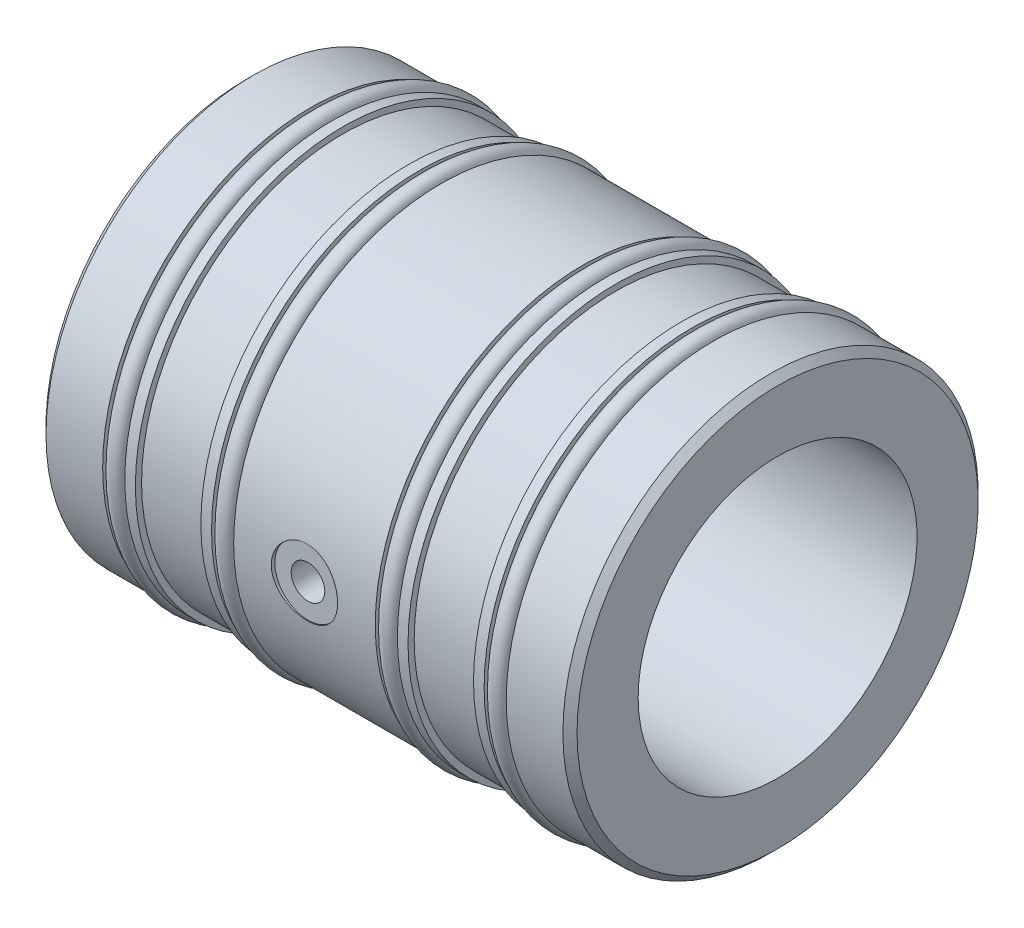
ISO-10303-21;
HEADER;
FILE_DESCRIPTION(('STEP AP214'),'2;1');
FILE_NAME('part.step','',(''),(''),'','','');
FILE_SCHEMA(('AUTOMOTIVE_DESIGN { 1 0 10303 214 1 1 1 1 }'));
ENDSEC;
DATA;
#1=APPLICATION_CONTEXT('core data for automotive mechanical design processes');
#2=APPLICATION_PROTOCOL_DEFINITION('international standard','automotive_design',2000,#1);
#3=PRODUCT_CONTEXT('',#1,'mechanical');
#4=PRODUCT('Part','Part','',(#3));
#5=PRODUCT_RELATED_PRODUCT_CATEGORY('part','',(#4));
#6=PRODUCT_DEFINITION_FORMATION('','',#4);
#7=PRODUCT_DEFINITION_CONTEXT('part definition',#1,'design');
#8=PRODUCT_DEFINITION('design','',#6,#7);
#9=PRODUCT_DEFINITION_SHAPE('','',#8);
#10=(LENGTH_UNIT() NAMED_UNIT(*) SI_UNIT(.MILLI.,.METRE.));
#11=(NAMED_UNIT(*) PLANE_ANGLE_UNIT() SI_UNIT($,.RADIAN.));
#12=(NAMED_UNIT(*) SI_UNIT($,.STERADIAN.) SOLID_ANGLE_UNIT());
#13=UNCERTAINTY_MEASURE_WITH_UNIT(LENGTH_MEASURE(1.E-05),#10,'distance_accuracy_value','');
#14=(GEOMETRIC_REPRESENTATION_CONTEXT(3) GLOBAL_UNCERTAINTY_ASSIGNED_CONTEXT((#13)) GLOBAL_UNIT_ASSIGNED_CONTEXT((#10,
#11,#12)) REPRESENTATION_CONTEXT('',''));
#15=CARTESIAN_POINT('',(0.,0.,0.));
#16=DIRECTION('',(0.,0.,1.));
#17=DIRECTION('',(1.,0.,0.));
#18=AXIS2_PLACEMENT_3D('',#15,#16,#17);
#19=CARTESIAN_POINT('',(10.7315,0.,0.));
#20=DIRECTION('',(-1.,0.,0.));
#21=DIRECTION('',(0.,0.,1.));
#22=AXIS2_PLACEMENT_3D('',#19,#20,#21);
#23=TOROIDAL_SURFACE('',#22,29.0957,1.2827);
#24=CARTESIAN_POINT('',(10.7315,0.,30.3784));
#25=VERTEX_POINT('',#24);
#26=VERTEX_LOOP('',#25);
#27=FACE_BOUND('',#26,.T.);
#28=ADVANCED_FACE('F47',(#27),#23,.T.);
#29=CLOSED_SHELL('',(#28));
#30=MANIFOLD_SOLID_BREP('B2',#29);
#31=CARTESIAN_POINT('',(26.3575,0.,0.));
#32=DIRECTION('',(-1.,0.,0.));
#33=DIRECTION('',(0.,0.,1.));
#34=AXIS2_PLACEMENT_3D('',#31,#32,#33);
#35=TOROIDAL_SURFACE('',#34,29.0957,1.2827);
#36=CARTESIAN_POINT('',(26.3575,0.,30.3784));
#37=VERTEX_POINT('',#36);
#38=VERTEX_LOOP('',#37);
#39=FACE_BOUND('',#38,.T.);
#40=ADVANCED_FACE('F65',(#39),#35,.T.);
#41=CLOSED_SHELL('',(#40));
#42=MANIFOLD_SOLID_BREP('B8',#41);
#43=CARTESIAN_POINT('',(49.8475,0.,0.));
#44=DIRECTION('',(-1.,0.,0.));
#45=DIRECTION('',(0.,0.,1.));
#46=AXIS2_PLACEMENT_3D('',#43,#44,#45);
#47=TOROIDAL_SURFACE('',#46,29.0957,1.2827);
#48=CARTESIAN_POINT('',(49.8475,0.,30.3784));
#49=VERTEX_POINT('',#48);
#50=VERTEX_LOOP('',#49);
#51=FACE_BOUND('',#50,.T.);
#52=ADVANCED_FACE('F85',(#51),#47,.T.);
#53=CLOSED_SHELL('',(#52));
#54=MANIFOLD_SOLID_BREP('B43',#53);
#55=CARTESIAN_POINT('',(65.4675,0.,0.));
#56=DIRECTION('',(-1.,0.,0.));
#57=DIRECTION('',(0.,0.,1.));
#58=AXIS2_PLACEMENT_3D('',#55,#56,#57);
#59=TOROIDAL_SURFACE('',#58,29.0957,1.28269999999999);
#60=CARTESIAN_POINT('',(65.4675,0.,30.3784));
#61=VERTEX_POINT('',#60);
#62=VERTEX_LOOP('',#61);
#63=FACE_BOUND('',#62,.T.);
#64=ADVANCED_FACE('F114',(#63),#59,.T.);
#65=CLOSED_SHELL('',(#64));
#66=MANIFOLD_SOLID_BREP('B61',#65);
#67=CARTESIAN_POINT('',(0.,20.01,0.));
#68=DIRECTION('',(1.,0.,0.));
#69=DIRECTION('',(0.,0.,-1.));
#70=AXIS2_PLACEMENT_3D('',#67,#68,#69);
#71=PLANE('',#70);
#72=CARTESIAN_POINT('',(0.,0.,0.));
#73=DIRECTION('',(1.,0.,0.));
#74=DIRECTION('',(0.,0.,-1.));
#75=AXIS2_PLACEMENT_3D('',#72,#73,#74);
#76=CIRCLE('',#75,28.7782);
#77=CARTESIAN_POINT('',(0.,0.,-28.7782));
#78=VERTEX_POINT('',#77);
#79=EDGE_CURVE('E255',#78,#78,#76,.F.);
#80=ORIENTED_EDGE('',*,*,#79,.T.);
#81=EDGE_LOOP('',(#80));
#82=FACE_BOUND('',#81,.T.);
#83=CARTESIAN_POINT('',(0.,0.,0.));
#84=DIRECTION('',(-1.,0.,0.));
#85=DIRECTION('',(0.,0.,1.));
#86=AXIS2_PLACEMENT_3D('',#83,#84,#85);
#87=CIRCLE('',#86,20.01);
#88=CARTESIAN_POINT('',(0.,0.,20.01));
#89=VERTEX_POINT('',#88);
#90=EDGE_CURVE('E177',#89,#89,#87,.T.);
#91=ORIENTED_EDGE('',*,*,#90,.F.);
#92=EDGE_LOOP('',(#91));
#93=FACE_BOUND('',#92,.T.);
#94=ADVANCED_FACE('F132',(#82,#93),#71,.F.);
#95=CARTESIAN_POINT('',(0.,0.,0.));
#96=DIRECTION('',(-1.,0.,0.));
#97=DIRECTION('',(0.,0.,1.));
#98=AXIS2_PLACEMENT_3D('',#95,#96,#97);
#99=CYLINDRICAL_SURFACE('',#98,29.7942);
#100=CARTESIAN_POINT('',(1.016,0.,0.));
#101=DIRECTION('',(1.,0.,0.));
#102=DIRECTION('',(0.,0.,-1.));
#103=AXIS2_PLACEMENT_3D('',#100,#101,#102);
#104=CIRCLE('',#103,29.7942);
#105=CARTESIAN_POINT('',(1.016,0.,-29.7942));
#106=VERTEX_POINT('',#105);
#107=EDGE_CURVE('E258',#106,#106,#104,.T.);
#108=ORIENTED_EDGE('',*,*,#107,.T.);
#109=EDGE_LOOP('',(#108));
#110=FACE_BOUND('',#109,.T.);
#111=CARTESIAN_POINT('',(9.144,0.,0.));
#112=DIRECTION('',(-1.,0.,0.));
#113=DIRECTION('',(0.,0.,1.));
#114=AXIS2_PLACEMENT_3D('',#111,#112,#113);
#115=CIRCLE('',#114,29.7942);
#116=CARTESIAN_POINT('',(9.144,0.,29.7942));
#117=VERTEX_POINT('',#116);
#118=EDGE_CURVE('E252',#117,#117,#115,.T.);
#119=ORIENTED_EDGE('',*,*,#118,.T.);
#120=EDGE_LOOP('',(#119));
#121=FACE_BOUND('',#120,.T.);
#122=ADVANCED_FACE('F353',(#110,#121),#99,.T.);
#123=CARTESIAN_POINT('',(9.144,29.7942,0.));
#124=DIRECTION('',(-1.,0.,0.));
#125=DIRECTION('',(0.,0.,1.));
#126=AXIS2_PLACEMENT_3D('',#123,#124,#125);
#127=PLANE('',#126);
#128=ORIENTED_EDGE('',*,*,#118,.F.);
#129=EDGE_LOOP('',(#128));
#130=FACE_BOUND('',#129,.T.);
#131=CARTESIAN_POINT('',(9.144,0.,0.));
#132=DIRECTION('',(-1.,0.,0.));
#133=DIRECTION('',(0.,0.,1.));
#134=AXIS2_PLACEMENT_3D('',#131,#132,#133);
#135=CIRCLE('',#134,27.813);
#136=CARTESIAN_POINT('',(9.144,0.,27.813));
#137=VERTEX_POINT('',#136);
#138=EDGE_CURVE('E249',#137,#137,#135,.T.);
#139=ORIENTED_EDGE('',*,*,#138,.T.);
#140=EDGE_LOOP('',(#139));
#141=FACE_BOUND('',#140,.T.);
#142=ADVANCED_FACE('F359',(#130,#141),#127,.F.);
#143=CARTESIAN_POINT('',(0.,0.,0.));
#144=DIRECTION('',(-1.,0.,0.));
#145=DIRECTION('',(0.,0.,1.));
#146=AXIS2_PLACEMENT_3D('',#143,#144,#145);
#147=CYLINDRICAL_SURFACE('',#146,27.813);
#148=ORIENTED_EDGE('',*,*,#138,.F.);
#149=EDGE_LOOP('',(#148));
#150=FACE_BOUND('',#149,.T.);
#151=CARTESIAN_POINT('',(12.319,0.,0.));
#152=DIRECTION('',(-1.,0.,0.));
#153=DIRECTION('',(0.,0.,1.));
#154=AXIS2_PLACEMENT_3D('',#151,#152,#153);
#155=CIRCLE('',#154,27.813);
#156=CARTESIAN_POINT('',(12.319,0.,27.813));
#157=VERTEX_POINT('',#156);
#158=EDGE_CURVE('E246',#157,#157,#155,.T.);
#159=ORIENTED_EDGE('',*,*,#158,.T.);
#160=EDGE_LOOP('',(#159));
#161=FACE_BOUND('',#160,.T.);
#162=ADVANCED_FACE('F383',(#150,#161),#147,.T.);
#163=CARTESIAN_POINT('',(12.319,27.813,0.));
#164=DIRECTION('',(1.,0.,0.));
#165=DIRECTION('',(0.,0.,-1.));
#166=AXIS2_PLACEMENT_3D('',#163,#164,#165);
#167=PLANE('',#166);
#168=ORIENTED_EDGE('',*,*,#158,.F.);
#169=EDGE_LOOP('',(#168));
#170=FACE_BOUND('',#169,.T.);
#171=CARTESIAN_POINT('',(12.319,0.,0.));
#172=DIRECTION('',(-1.,0.,0.));
#173=DIRECTION('',(0.,0.,1.));
#174=AXIS2_PLACEMENT_3D('',#171,#172,#173);
#175=CIRCLE('',#174,29.7942);
#176=CARTESIAN_POINT('',(12.319,0.,29.7942));
#177=VERTEX_POINT('',#176);
#178=EDGE_CURVE('E243',#177,#177,#175,.T.);
#179=ORIENTED_EDGE('',*,*,#178,.T.);
#180=EDGE_LOOP('',(#179));
#181=FACE_BOUND('',#180,.T.);
#182=ADVANCED_FACE('F388',(#170,#181),#167,.F.);
#183=CARTESIAN_POINT('',(0.,0.,0.));
#184=DIRECTION('',(-1.,0.,0.));
#185=DIRECTION('',(0.,0.,1.));
#186=AXIS2_PLACEMENT_3D('',#183,#184,#185);
#187=CYLINDRICAL_SURFACE('',#186,29.7942);
#188=ORIENTED_EDGE('',*,*,#178,.F.);
#189=EDGE_LOOP('',(#188));
#190=FACE_BOUND('',#189,.T.);
#191=CARTESIAN_POINT('',(13.84,0.,0.));
#192=DIRECTION('',(-1.,0.,0.));
#193=DIRECTION('',(0.,0.,1.));
#194=AXIS2_PLACEMENT_3D('',#191,#192,#193);
#195=CIRCLE('',#194,29.7942);
#196=CARTESIAN_POINT('',(13.84,0.,29.7942));
#197=VERTEX_POINT('',#196);
#198=EDGE_CURVE('E240',#197,#197,#195,.T.);
#199=ORIENTED_EDGE('',*,*,#198,.T.);
#200=EDGE_LOOP('',(#199));
#201=FACE_BOUND('',#200,.T.);
#202=ADVANCED_FACE('F394',(#190,#201),#187,.T.);
#203=CARTESIAN_POINT('',(13.84,29.7942,0.));
#204=DIRECTION('',(-1.,0.,0.));
#205=DIRECTION('',(0.,0.,1.));
#206=AXIS2_PLACEMENT_3D('',#203,#204,#205);
#207=PLANE('',#206);
#208=ORIENTED_EDGE('',*,*,#198,.F.);
#209=EDGE_LOOP('',(#208));
#210=FACE_BOUND('',#209,.T.);
#211=CARTESIAN_POINT('',(13.84,0.,0.));
#212=DIRECTION('',(-1.,0.,0.));
#213=DIRECTION('',(0.,0.,1.));
#214=AXIS2_PLACEMENT_3D('',#211,#212,#213);
#215=CIRCLE('',#214,28.905);
#216=CARTESIAN_POINT('',(13.84,0.,28.905));
#217=VERTEX_POINT('',#216);
#218=EDGE_CURVE('E237',#217,#217,#215,.T.);
#219=ORIENTED_EDGE('',*,*,#218,.T.);
#220=EDGE_LOOP('',(#219));
#221=FACE_BOUND('',#220,.T.);
#222=ADVANCED_FACE('F400',(#210,#221),#207,.F.);
#223=CARTESIAN_POINT('',(0.,0.,0.));
#224=DIRECTION('',(-1.,0.,0.));
#225=DIRECTION('',(0.,0.,1.));
#226=AXIS2_PLACEMENT_3D('',#223,#224,#225);
#227=CYLINDRICAL_SURFACE('',#226,28.905);
#228=ORIENTED_EDGE('',*,*,#218,.F.);
#229=EDGE_LOOP('',(#228));
#230=FACE_BOUND('',#229,.T.);
#231=CARTESIAN_POINT('',(23.238,0.,0.));
#232=DIRECTION('',(-1.,0.,0.));
#233=DIRECTION('',(0.,0.,1.));
#234=AXIS2_PLACEMENT_3D('',#231,#232,#233);
#235=CIRCLE('',#234,28.905);
#236=CARTESIAN_POINT('',(23.238,0.,28.905));
#237=VERTEX_POINT('',#236);
#238=EDGE_CURVE('E234',#237,#237,#235,.T.);
#239=ORIENTED_EDGE('',*,*,#238,.T.);
#240=EDGE_LOOP('',(#239));
#241=FACE_BOUND('',#240,.T.);
#242=ADVANCED_FACE('F406',(#230,#241),#227,.T.);
#243=CARTESIAN_POINT('',(23.238,28.905,0.));
#244=DIRECTION('',(1.,0.,0.));
#245=DIRECTION('',(0.,0.,-1.));
#246=AXIS2_PLACEMENT_3D('',#243,#244,#245);
#247=PLANE('',#246);
#248=ORIENTED_EDGE('',*,*,#238,.F.);
#249=EDGE_LOOP('',(#248));
#250=FACE_BOUND('',#249,.T.);
#251=CARTESIAN_POINT('',(23.238,0.,0.));
#252=DIRECTION('',(-1.,0.,0.));
#253=DIRECTION('',(0.,0.,1.));
#254=AXIS2_PLACEMENT_3D('',#251,#252,#253);
#255=CIRCLE('',#254,29.7942);
#256=CARTESIAN_POINT('',(23.238,0.,29.7942));
#257=VERTEX_POINT('',#256);
#258=EDGE_CURVE('E231',#257,#257,#255,.T.);
#259=ORIENTED_EDGE('',*,*,#258,.T.);
#260=EDGE_LOOP('',(#259));
#261=FACE_BOUND('',#260,.T.);
#262=ADVANCED_FACE('F412',(#250,#261),#247,.F.);
#263=CARTESIAN_POINT('',(0.,0.,0.));
#264=DIRECTION('',(-1.,0.,0.));
#265=DIRECTION('',(0.,0.,1.));
#266=AXIS2_PLACEMENT_3D('',#263,#264,#265);
#267=CYLINDRICAL_SURFACE('',#266,29.7942);
#268=ORIENTED_EDGE('',*,*,#258,.F.);
#269=EDGE_LOOP('',(#268));
#270=FACE_BOUND('',#269,.T.);
#271=CARTESIAN_POINT('',(24.77,0.,0.));
#272=DIRECTION('',(-1.,0.,0.));
#273=DIRECTION('',(0.,0.,1.));
#274=AXIS2_PLACEMENT_3D('',#271,#272,#273);
#275=CIRCLE('',#274,29.7942);
#276=CARTESIAN_POINT('',(24.77,0.,29.7942));
#277=VERTEX_POINT('',#276);
#278=EDGE_CURVE('E228',#277,#277,#275,.T.);
#279=ORIENTED_EDGE('',*,*,#278,.T.);
#280=EDGE_LOOP('',(#279));
#281=FACE_BOUND('',#280,.T.);
#282=ADVANCED_FACE('F418',(#270,#281),#267,.T.);
#283=CARTESIAN_POINT('',(24.77,29.7942,0.));
#284=DIRECTION('',(-1.,0.,0.));
#285=DIRECTION('',(0.,0.,1.));
#286=AXIS2_PLACEMENT_3D('',#283,#284,#285);
#287=PLANE('',#286);
#288=ORIENTED_EDGE('',*,*,#278,.F.);
#289=EDGE_LOOP('',(#288));
#290=FACE_BOUND('',#289,.T.);
#291=CARTESIAN_POINT('',(24.77,0.,0.));
#292=DIRECTION('',(-1.,0.,0.));
#293=DIRECTION('',(0.,0.,1.));
#294=AXIS2_PLACEMENT_3D('',#291,#292,#293);
#295=CIRCLE('',#294,27.813);
#296=CARTESIAN_POINT('',(24.77,0.,27.813));
#297=VERTEX_POINT('',#296);
#298=EDGE_CURVE('E225',#297,#297,#295,.T.);
#299=ORIENTED_EDGE('',*,*,#298,.T.);
#300=EDGE_LOOP('',(#299));
#301=FACE_BOUND('',#300,.T.);
#302=ADVANCED_FACE('F424',(#290,#301),#287,.F.);
#303=CARTESIAN_POINT('',(0.,0.,0.));
#304=DIRECTION('',(-1.,0.,0.));
#305=DIRECTION('',(0.,0.,1.));
#306=AXIS2_PLACEMENT_3D('',#303,#304,#305);
#307=CYLINDRICAL_SURFACE('',#306,27.813);
#308=ORIENTED_EDGE('',*,*,#298,.F.);
#309=EDGE_LOOP('',(#308));
#310=FACE_BOUND('',#309,.T.);
#311=CARTESIAN_POINT('',(27.945,0.,0.));
#312=DIRECTION('',(-1.,0.,0.));
#313=DIRECTION('',(0.,0.,1.));
#314=AXIS2_PLACEMENT_3D('',#311,#312,#313);
#315=CIRCLE('',#314,27.813);
#316=CARTESIAN_POINT('',(27.945,0.,27.813));
#317=VERTEX_POINT('',#316);
#318=EDGE_CURVE('E222',#317,#317,#315,.T.);
#319=ORIENTED_EDGE('',*,*,#318,.T.);
#320=EDGE_LOOP('',(#319));
#321=FACE_BOUND('',#320,.T.);
#322=ADVANCED_FACE('F430',(#310,#321),#307,.T.);
#323=CARTESIAN_POINT('',(27.945,27.813,0.));
#324=DIRECTION('',(1.,0.,0.));
#325=DIRECTION('',(0.,0.,-1.));
#326=AXIS2_PLACEMENT_3D('',#323,#324,#325);
#327=PLANE('',#326);
#328=ORIENTED_EDGE('',*,*,#318,.F.);
#329=EDGE_LOOP('',(#328));
#330=FACE_BOUND('',#329,.T.);
#331=CARTESIAN_POINT('',(27.945,0.,0.));
#332=DIRECTION('',(-1.,0.,0.));
#333=DIRECTION('',(0.,0.,1.));
#334=AXIS2_PLACEMENT_3D('',#331,#332,#333);
#335=CIRCLE('',#334,29.7942);
#336=CARTESIAN_POINT('',(27.945,0.,29.7942));
#337=VERTEX_POINT('',#336);
#338=EDGE_CURVE('E219',#337,#337,#335,.T.);
#339=ORIENTED_EDGE('',*,*,#338,.T.);
#340=EDGE_LOOP('',(#339));
#341=FACE_BOUND('',#340,.T.);
#342=ADVANCED_FACE('F272',(#330,#341),#327,.F.);
#343=CARTESIAN_POINT('',(0.,0.,0.));
#344=DIRECTION('',(-1.,0.,0.));
#345=DIRECTION('',(0.,0.,1.));
#346=AXIS2_PLACEMENT_3D('',#343,#344,#345);
#347=CYLINDRICAL_SURFACE('',#346,29.7942);
#348=CARTESIAN_POINT('',(42.8625,0.,29.7942));
#349=CARTESIAN_POINT('',(42.8624892132007,-0.265696232656299,29.794195559683));
#350=CARTESIAN_POINT('',(42.8401904243504,-0.531541341606855,29.7906087780758));
#351=CARTESIAN_POINT('',(42.7516154043679,-1.05578611869581,29.7766457031698));
#352=CARTESIAN_POINT('',(42.6852977293445,-1.31417853064853,29.7662630116329));
#353=CARTESIAN_POINT('',(42.5107295237931,-1.81585641103358,29.7398736116883));
#354=CARTESIAN_POINT('',(42.4025121998012,-2.05915366604217,29.7238713578581));
#355=CARTESIAN_POINT('',(42.1473011401955,-2.52410305641405,29.6880060098751));
#356=CARTESIAN_POINT('',(42.0003122382858,-2.74575788525074,29.6681433970794));
#357=CARTESIAN_POINT('',(41.6703497389242,-3.16312009014098,29.6265661430495));
#358=CARTESIAN_POINT('',(41.4871011840987,-3.3586087774373,29.604838117186));
#359=CARTESIAN_POINT('',(41.0904129328182,-3.71620137472666,29.5620823361833));
#360=CARTESIAN_POINT('',(40.8769714049956,-3.87830325816326,29.5410546236177));
#361=CARTESIAN_POINT('',(40.424467464009,-4.16538673051056,29.5019506138127));
#362=CARTESIAN_POINT('',(40.1852674622557,-4.2901540121259,29.4838916144468));
#363=CARTESIAN_POINT('',(39.6889686423679,-4.49765652571107,29.4529542513037));
#364=CARTESIAN_POINT('',(39.4318709352742,-4.58039436411361,29.4400755662825));
#365=CARTESIAN_POINT('',(38.9093854870388,-4.70080443550343,29.4210895854793));
#366=CARTESIAN_POINT('',(38.6440865488815,-4.73885292859874,29.4149257864008));
#367=CARTESIAN_POINT('',(38.1108036737489,-4.76997043930542,29.4098962949859));
#368=CARTESIAN_POINT('',(37.8428199127547,-4.76304238597054,29.4110301273984));
#369=CARTESIAN_POINT('',(37.3144485642113,-4.70471036587982,29.4204161667424));
#370=CARTESIAN_POINT('',(37.0540131114632,-4.65372754405118,29.4286009671502));
#371=CARTESIAN_POINT('',(36.545440957085,-4.50939342311139,29.4510613010367));
#372=CARTESIAN_POINT('',(36.2973046465606,-4.4160407776212,29.4653370280648));
#373=CARTESIAN_POINT('',(35.8191050133464,-4.18918532900835,29.4984442098889));
#374=CARTESIAN_POINT('',(35.5891267898023,-4.05550617044315,29.5172956026997));
#375=CARTESIAN_POINT('',(35.154706324263,-3.75191772700624,29.5574159639437));
#376=CARTESIAN_POINT('',(34.9502659831676,-3.58200574770758,29.5786851121165));
#377=CARTESIAN_POINT('',(34.5702855259249,-3.20847301330683,29.6215413689111));
#378=CARTESIAN_POINT('',(34.3951008315647,-3.00449060216417,29.6431293411708));
#379=CARTESIAN_POINT('',(34.0813944382334,-2.5698344406157,29.6839666176117));
#380=CARTESIAN_POINT('',(33.9428729417096,-2.33916054283461,29.7032159088789));
#381=CARTESIAN_POINT('',(33.7063986670976,-1.85734621964429,29.7372311409213));
#382=CARTESIAN_POINT('',(33.6084756100169,-1.60619096078455,29.751993795049));
#383=CARTESIAN_POINT('',(33.4562989241362,-1.09071109344829,29.7753455868714));
#384=CARTESIAN_POINT('',(33.4020419383335,-0.826387498999312,29.7839351991376));
#385=CARTESIAN_POINT('',(33.3392154875883,-0.295139277827396,29.7939096827259));
#386=CARTESIAN_POINT('',(33.3301578038739,-0.0282737826080876,29.7953715402873));
#387=CARTESIAN_POINT('',(33.356687875127,0.503163101458383,29.7911361161876));
#388=CARTESIAN_POINT('',(33.3922740543942,0.767734570941078,29.7854390871986));
#389=CARTESIAN_POINT('',(33.5066756444049,1.28557747481115,29.7675736470928));
#390=CARTESIAN_POINT('',(33.5852509685452,1.53890329617438,29.755441188056));
#391=CARTESIAN_POINT('',(33.7831456063307,2.02878586382143,29.7260602105885));
#392=CARTESIAN_POINT('',(33.9024670532978,2.26534173130696,29.7088114242915));
#393=CARTESIAN_POINT('',(34.1795964674922,2.71710114333156,29.6709214992288));
#394=CARTESIAN_POINT('',(34.3377113988256,2.93211410866257,29.6502537542425));
#395=CARTESIAN_POINT('',(34.6875150748913,3.33272825549375,29.6079031927198));
#396=CARTESIAN_POINT('',(34.8792060514233,3.51832748029971,29.5862203087774));
#397=CARTESIAN_POINT('',(35.2929033549082,3.85664141510984,29.5440363491409));
#398=CARTESIAN_POINT('',(35.5151801110021,4.00902733574642,29.5235484415801));
#399=CARTESIAN_POINT('',(35.9824632900143,4.2742973238587,29.4863146934338));
#400=CARTESIAN_POINT('',(36.2274690353386,4.38718256844568,29.4695687413442));
#401=CARTESIAN_POINT('',(36.7323103456274,4.56974751333859,29.4418123130385));
#402=CARTESIAN_POINT('',(36.9920840268163,4.63959480943337,29.4307796157571));
#403=CARTESIAN_POINT('',(37.5198662282977,4.73463118852356,29.4156416999991));
#404=CARTESIAN_POINT('',(37.7878740935969,4.75982381429366,29.4115359319607));
#405=CARTESIAN_POINT('',(38.3212363613274,4.76474301876427,29.4107391124701));
#406=CARTESIAN_POINT('',(38.5865860100168,4.74498687303457,29.4139637020701));
#407=CARTESIAN_POINT('',(39.1101354014613,4.66168363339068,29.4272800363468));
#408=CARTESIAN_POINT('',(39.3683351622087,4.5981366496841,29.437371763741));
#409=CARTESIAN_POINT('',(39.8700792261828,4.42924741527534,29.463254307839));
#410=CARTESIAN_POINT('',(40.1136376433404,4.3239461836548,29.4790395299219));
#411=CARTESIAN_POINT('',(40.5797147890151,4.07458993399587,29.5145364400838));
#412=CARTESIAN_POINT('',(40.8022326117128,3.93053324852083,29.5342482970951));
#413=CARTESIAN_POINT('',(41.2225318392057,3.60589511059689,29.5756465063843));
#414=CARTESIAN_POINT('',(41.4200165887492,3.42493198692763,29.5973520695366));
#415=CARTESIAN_POINT('',(41.7819959614207,3.03242391529968,29.6401358015303));
#416=CARTESIAN_POINT('',(41.9464829404955,2.82087190079933,29.6612138240389));
#417=CARTESIAN_POINT('',(42.2387370524599,2.37161206434717,29.7005207048717));
#418=CARTESIAN_POINT('',(42.3662661536999,2.13374775550444,29.718730763375));
#419=CARTESIAN_POINT('',(42.5793652180296,1.63978601745139,29.7500665840168));
#420=CARTESIAN_POINT('',(42.6649776761307,1.38370735690902,29.7631974925394));
#421=CARTESIAN_POINT('',(42.7728753814766,0.938806062923658,29.7799742211443));
#422=CARTESIAN_POINT('',(42.8064318342777,0.752698806503795,29.7852808474148));
#423=CARTESIAN_POINT('',(42.8512478100722,0.377752760301309,29.7923952890062));
#424=CARTESIAN_POINT('',(42.8625076695763,0.188914011786973,29.7942031571321));
#425=CARTESIAN_POINT('',(42.8625,0.,29.7942));
#426=B_SPLINE_CURVE_WITH_KNOTS('',3,(#348,#349,#350,#351,#352,#353,#354,#355,#356,#357,#358,
#359,#360,#361,#362,#363,#364,#365,#366,#367,#368,#369,#370,#371,#372,#373,#374,#375,#376,#377,
#378,#379,#380,#381,#382,#383,#384,#385,#386,#387,#388,#389,#390,#391,#392,#393,#394,#395,#396,
#397,#398,#399,#400,#401,#402,#403,#404,#405,#406,#407,#408,#409,#410,#411,#412,#413,#414,#415,
#416,#417,#418,#419,#420,#421,#422,#423,#424,#425),.UNSPECIFIED.,.T.,.F.,(4,2,2,2,2,2,2,2,2,2,2,
2,2,2,2,2,2,2,2,2,2,2,2,2,2,2,2,2,2,2,2,2,2,2,2,2,2,2,4),(0.,0.796398257730296,1.59354739199217,
2.39006605422568,3.18648546031761,3.98919307483198,4.79194939880614,5.59922899038845,
6.4064585128591,7.20684174014405,8.00717284377472,8.79993671242683,9.59272577437232,
10.3890333894626,11.1854002420439,11.9908312043927,12.7962666140875,13.6022906242881,
14.4082526622677,15.2054899941328,16.0026991883847,16.7955008995793,17.5883441254124,
18.3876755964932,19.1870602193085,19.9940310074063,20.8009777459075,21.6047619263688,
22.4084823340219,23.203000283611,23.9975162336586,24.791253582914,25.5850250878388,
26.3874645539626,27.1900896939853,27.9977748509891,28.8046394740628,29.3708991423659,
29.9371502643478),.UNSPECIFIED.);
#427=CARTESIAN_POINT('',(33.3375,0.,29.7942));
#428=VERTEX_POINT('',#427);
#429=CARTESIAN_POINT('',(42.8625,0.,29.7942));
#430=VERTEX_POINT('',#429);
#431=EDGE_CURVE('E136',#428,#430,#426,.T.);
#432=ORIENTED_EDGE('',*,*,#431,.T.);
#433=EDGE_CURVE('E112',#430,#428,#426,.T.);
#434=ORIENTED_EDGE('',*,*,#433,.T.);
#435=EDGE_LOOP('',(#432,#434));
#436=FACE_BOUND('',#435,.T.);
#437=ORIENTED_EDGE('',*,*,#338,.F.);
#438=EDGE_LOOP('',(#437));
#439=FACE_BOUND('',#438,.T.);
#440=CARTESIAN_POINT('',(48.26,0.,0.));
#441=DIRECTION('',(-1.,0.,0.));
#442=DIRECTION('',(0.,0.,1.));
#443=AXIS2_PLACEMENT_3D('',#440,#441,#442);
#444=CIRCLE('',#443,29.7942);
#445=CARTESIAN_POINT('',(48.26,0.,29.7942));
#446=VERTEX_POINT('',#445);
#447=EDGE_CURVE('E216',#446,#446,#444,.T.);
#448=ORIENTED_EDGE('',*,*,#447,.T.);
#449=EDGE_LOOP('',(#448));
#450=FACE_BOUND('',#449,.T.);
#451=ADVANCED_FACE('F268',(#436,#439,#450),#347,.T.);
#452=CARTESIAN_POINT('',(48.26,29.7942,0.));
#453=DIRECTION('',(-1.,0.,0.));
#454=DIRECTION('',(0.,0.,1.));
#455=AXIS2_PLACEMENT_3D('',#452,#453,#454);
#456=PLANE('',#455);
#457=ORIENTED_EDGE('',*,*,#447,.F.);
#458=EDGE_LOOP('',(#457));
#459=FACE_BOUND('',#458,.T.);
#460=CARTESIAN_POINT('',(48.26,0.,0.));
#461=DIRECTION('',(-1.,0.,0.));
#462=DIRECTION('',(0.,0.,1.));
#463=AXIS2_PLACEMENT_3D('',#460,#461,#462);
#464=CIRCLE('',#463,27.813);
#465=CARTESIAN_POINT('',(48.26,0.,27.813));
#466=VERTEX_POINT('',#465);
#467=EDGE_CURVE('E213',#466,#466,#464,.T.);
#468=ORIENTED_EDGE('',*,*,#467,.T.);
#469=EDGE_LOOP('',(#468));
#470=FACE_BOUND('',#469,.T.);
#471=ADVANCED_FACE('F271',(#459,#470),#456,.F.);
#472=CARTESIAN_POINT('',(0.,0.,0.));
#473=DIRECTION('',(-1.,0.,0.));
#474=DIRECTION('',(0.,0.,1.));
#475=AXIS2_PLACEMENT_3D('',#472,#473,#474);
#476=CYLINDRICAL_SURFACE('',#475,27.813);
#477=ORIENTED_EDGE('',*,*,#467,.F.);
#478=EDGE_LOOP('',(#477));
#479=FACE_BOUND('',#478,.T.);
#480=CARTESIAN_POINT('',(51.435,0.,0.));
#481=DIRECTION('',(-1.,0.,0.));
#482=DIRECTION('',(0.,0.,1.));
#483=AXIS2_PLACEMENT_3D('',#480,#481,#482);
#484=CIRCLE('',#483,27.813);
#485=CARTESIAN_POINT('',(51.435,0.,27.813));
#486=VERTEX_POINT('',#485);
#487=EDGE_CURVE('E210',#486,#486,#484,.T.);
#488=ORIENTED_EDGE('',*,*,#487,.T.);
#489=EDGE_LOOP('',(#488));
#490=FACE_BOUND('',#489,.T.);
#491=ADVANCED_FACE('F279',(#479,#490),#476,.T.);
#492=CARTESIAN_POINT('',(51.435,29.7942,0.));
#493=DIRECTION('',(1.,0.,0.));
#494=DIRECTION('',(0.,0.,-1.));
#495=AXIS2_PLACEMENT_3D('',#492,#493,#494);
#496=PLANE('',#495);
#497=ORIENTED_EDGE('',*,*,#487,.F.);
#498=EDGE_LOOP('',(#497));
#499=FACE_BOUND('',#498,.T.);
#500=CARTESIAN_POINT('',(51.435,0.,0.));
#501=DIRECTION('',(-1.,0.,0.));
#502=DIRECTION('',(0.,0.,1.));
#503=AXIS2_PLACEMENT_3D('',#500,#501,#502);
#504=CIRCLE('',#503,29.7942);
#505=CARTESIAN_POINT('',(51.435,0.,29.7942));
#506=VERTEX_POINT('',#505);
#507=EDGE_CURVE('E207',#506,#506,#504,.T.);
#508=ORIENTED_EDGE('',*,*,#507,.T.);
#509=EDGE_LOOP('',(#508));
#510=FACE_BOUND('',#509,.T.);
#511=ADVANCED_FACE('F285',(#499,#510),#496,.F.);
#512=CARTESIAN_POINT('',(0.,0.,0.));
#513=DIRECTION('',(-1.,0.,0.));
#514=DIRECTION('',(0.,0.,1.));
#515=AXIS2_PLACEMENT_3D('',#512,#513,#514);
#516=CYLINDRICAL_SURFACE('',#515,29.7942);
#517=ORIENTED_EDGE('',*,*,#507,.F.);
#518=EDGE_LOOP('',(#517));
#519=FACE_BOUND('',#518,.T.);
#520=CARTESIAN_POINT('',(52.96,0.,0.));
#521=DIRECTION('',(-1.,0.,0.));
#522=DIRECTION('',(0.,0.,1.));
#523=AXIS2_PLACEMENT_3D('',#520,#521,#522);
#524=CIRCLE('',#523,29.7942);
#525=CARTESIAN_POINT('',(52.96,0.,29.7942));
#526=VERTEX_POINT('',#525);
#527=EDGE_CURVE('E204',#526,#526,#524,.T.);
#528=ORIENTED_EDGE('',*,*,#527,.T.);
#529=EDGE_LOOP('',(#528));
#530=FACE_BOUND('',#529,.T.);
#531=ADVANCED_FACE('F291',(#519,#530),#516,.T.);
#532=CARTESIAN_POINT('',(52.96,28.905,0.));
#533=DIRECTION('',(-1.,0.,0.));
#534=DIRECTION('',(0.,0.,1.));
#535=AXIS2_PLACEMENT_3D('',#532,#533,#534);
#536=PLANE('',#535);
#537=ORIENTED_EDGE('',*,*,#527,.F.);
#538=EDGE_LOOP('',(#537));
#539=FACE_BOUND('',#538,.T.);
#540=CARTESIAN_POINT('',(52.96,0.,0.));
#541=DIRECTION('',(-1.,0.,0.));
#542=DIRECTION('',(0.,0.,1.));
#543=AXIS2_PLACEMENT_3D('',#540,#541,#542);
#544=CIRCLE('',#543,28.905);
#545=CARTESIAN_POINT('',(52.96,0.,28.905));
#546=VERTEX_POINT('',#545);
#547=EDGE_CURVE('E201',#546,#546,#544,.T.);
#548=ORIENTED_EDGE('',*,*,#547,.T.);
#549=EDGE_LOOP('',(#548));
#550=FACE_BOUND('',#549,.T.);
#551=ADVANCED_FACE('F297',(#539,#550),#536,.F.);
#552=CARTESIAN_POINT('',(0.,0.,0.));
#553=DIRECTION('',(-1.,0.,0.));
#554=DIRECTION('',(0.,0.,1.));
#555=AXIS2_PLACEMENT_3D('',#552,#553,#554);
#556=CYLINDRICAL_SURFACE('',#555,28.905);
#557=ORIENTED_EDGE('',*,*,#547,.F.);
#558=EDGE_LOOP('',(#557));
#559=FACE_BOUND('',#558,.T.);
#560=CARTESIAN_POINT('',(62.358,0.,0.));
#561=DIRECTION('',(-1.,0.,0.));
#562=DIRECTION('',(0.,0.,1.));
#563=AXIS2_PLACEMENT_3D('',#560,#561,#562);
#564=CIRCLE('',#563,28.905);
#565=CARTESIAN_POINT('',(62.358,0.,28.905));
#566=VERTEX_POINT('',#565);
#567=EDGE_CURVE('E198',#566,#566,#564,.T.);
#568=ORIENTED_EDGE('',*,*,#567,.T.);
#569=EDGE_LOOP('',(#568));
#570=FACE_BOUND('',#569,.T.);
#571=ADVANCED_FACE('F303',(#559,#570),#556,.T.);
#572=CARTESIAN_POINT('',(62.358,29.7942,0.));
#573=DIRECTION('',(1.,0.,0.));
#574=DIRECTION('',(0.,0.,-1.));
#575=AXIS2_PLACEMENT_3D('',#572,#573,#574);
#576=PLANE('',#575);
#577=ORIENTED_EDGE('',*,*,#567,.F.);
#578=EDGE_LOOP('',(#577));
#579=FACE_BOUND('',#578,.T.);
#580=CARTESIAN_POINT('',(62.358,0.,0.));
#581=DIRECTION('',(-1.,0.,0.));
#582=DIRECTION('',(0.,0.,1.));
#583=AXIS2_PLACEMENT_3D('',#580,#581,#582);
#584=CIRCLE('',#583,29.7942);
#585=CARTESIAN_POINT('',(62.358,0.,29.7942));
#586=VERTEX_POINT('',#585);
#587=EDGE_CURVE('E195',#586,#586,#584,.T.);
#588=ORIENTED_EDGE('',*,*,#587,.T.);
#589=EDGE_LOOP('',(#588));
#590=FACE_BOUND('',#589,.T.);
#591=ADVANCED_FACE('F309',(#579,#590),#576,.F.);
#592=CARTESIAN_POINT('',(0.,0.,0.));
#593=DIRECTION('',(-1.,0.,0.));
#594=DIRECTION('',(0.,0.,1.));
#595=AXIS2_PLACEMENT_3D('',#592,#593,#594);
#596=CYLINDRICAL_SURFACE('',#595,29.7942);
#597=ORIENTED_EDGE('',*,*,#587,.F.);
#598=EDGE_LOOP('',(#597));
#599=FACE_BOUND('',#598,.T.);
#600=CARTESIAN_POINT('',(63.88,0.,0.));
#601=DIRECTION('',(-1.,0.,0.));
#602=DIRECTION('',(0.,0.,1.));
#603=AXIS2_PLACEMENT_3D('',#600,#601,#602);
#604=CIRCLE('',#603,29.7942);
#605=CARTESIAN_POINT('',(63.88,0.,29.7942));
#606=VERTEX_POINT('',#605);
#607=EDGE_CURVE('E192',#606,#606,#604,.T.);
#608=ORIENTED_EDGE('',*,*,#607,.T.);
#609=EDGE_LOOP('',(#608));
#610=FACE_BOUND('',#609,.T.);
#611=ADVANCED_FACE('F315',(#599,#610),#596,.T.);
#612=CARTESIAN_POINT('',(63.88,27.813,0.));
#613=DIRECTION('',(-1.,0.,0.));
#614=DIRECTION('',(0.,0.,1.));
#615=AXIS2_PLACEMENT_3D('',#612,#613,#614);
#616=PLANE('',#615);
#617=ORIENTED_EDGE('',*,*,#607,.F.);
#618=EDGE_LOOP('',(#617));
#619=FACE_BOUND('',#618,.T.);
#620=CARTESIAN_POINT('',(63.88,0.,0.));
#621=DIRECTION('',(-1.,0.,0.));
#622=DIRECTION('',(0.,0.,1.));
#623=AXIS2_PLACEMENT_3D('',#620,#621,#622);
#624=CIRCLE('',#623,27.813);
#625=CARTESIAN_POINT('',(63.88,0.,27.813));
#626=VERTEX_POINT('',#625);
#627=EDGE_CURVE('E189',#626,#626,#624,.T.);
#628=ORIENTED_EDGE('',*,*,#627,.T.);
#629=EDGE_LOOP('',(#628));
#630=FACE_BOUND('',#629,.T.);
#631=ADVANCED_FACE('F321',(#619,#630),#616,.F.);
#632=CARTESIAN_POINT('',(0.,0.,0.));
#633=DIRECTION('',(-1.,0.,0.));
#634=DIRECTION('',(0.,0.,1.));
#635=AXIS2_PLACEMENT_3D('',#632,#633,#634);
#636=CYLINDRICAL_SURFACE('',#635,27.813);
#637=ORIENTED_EDGE('',*,*,#627,.F.);
#638=EDGE_LOOP('',(#637));
#639=FACE_BOUND('',#638,.T.);
#640=CARTESIAN_POINT('',(67.055,0.,0.));
#641=DIRECTION('',(-1.,0.,0.));
#642=DIRECTION('',(0.,0.,1.));
#643=AXIS2_PLACEMENT_3D('',#640,#641,#642);
#644=CIRCLE('',#643,27.813);
#645=CARTESIAN_POINT('',(67.055,0.,27.813));
#646=VERTEX_POINT('',#645);
#647=EDGE_CURVE('E186',#646,#646,#644,.T.);
#648=ORIENTED_EDGE('',*,*,#647,.T.);
#649=EDGE_LOOP('',(#648));
#650=FACE_BOUND('',#649,.T.);
#651=ADVANCED_FACE('F327',(#639,#650),#636,.T.);
#652=CARTESIAN_POINT('',(67.055,29.7942,0.));
#653=DIRECTION('',(1.,0.,0.));
#654=DIRECTION('',(0.,0.,-1.));
#655=AXIS2_PLACEMENT_3D('',#652,#653,#654);
#656=PLANE('',#655);
#657=ORIENTED_EDGE('',*,*,#647,.F.);
#658=EDGE_LOOP('',(#657));
#659=FACE_BOUND('',#658,.T.);
#660=CARTESIAN_POINT('',(67.055,0.,0.));
#661=DIRECTION('',(-1.,0.,0.));
#662=DIRECTION('',(0.,0.,1.));
#663=AXIS2_PLACEMENT_3D('',#660,#661,#662);
#664=CIRCLE('',#663,29.7942);
#665=CARTESIAN_POINT('',(67.055,0.,29.7942));
#666=VERTEX_POINT('',#665);
#667=EDGE_CURVE('E183',#666,#666,#664,.T.);
#668=ORIENTED_EDGE('',*,*,#667,.T.);
#669=EDGE_LOOP('',(#668));
#670=FACE_BOUND('',#669,.T.);
#671=ADVANCED_FACE('F333',(#659,#670),#656,.F.);
#672=CARTESIAN_POINT('',(0.,0.,0.));
#673=DIRECTION('',(-1.,0.,0.));
#674=DIRECTION('',(0.,0.,1.));
#675=AXIS2_PLACEMENT_3D('',#672,#673,#674);
#676=CYLINDRICAL_SURFACE('',#675,29.7942);
#677=CARTESIAN_POINT('',(75.184,0.,0.));
#678=DIRECTION('',(-1.,0.,0.));
#679=DIRECTION('',(0.,0.,1.));
#680=AXIS2_PLACEMENT_3D('',#677,#678,#679);
#681=CIRCLE('',#680,29.7942);
#682=CARTESIAN_POINT('',(75.184,0.,29.7942));
#683=VERTEX_POINT('',#682);
#684=EDGE_CURVE('E261',#683,#683,#681,.T.);
#685=ORIENTED_EDGE('',*,*,#684,.T.);
#686=EDGE_LOOP('',(#685));
#687=FACE_BOUND('',#686,.T.);
#688=ORIENTED_EDGE('',*,*,#667,.F.);
#689=EDGE_LOOP('',(#688));
#690=FACE_BOUND('',#689,.T.);
#691=ADVANCED_FACE('F339',(#687,#690),#676,.T.);
#692=CARTESIAN_POINT('',(76.2,20.01,0.));
#693=DIRECTION('',(-1.,0.,0.));
#694=DIRECTION('',(0.,0.,1.));
#695=AXIS2_PLACEMENT_3D('',#692,#693,#694);
#696=PLANE('',#695);
#697=CARTESIAN_POINT('',(76.2,0.,0.));
#698=DIRECTION('',(-1.,0.,0.));
#699=DIRECTION('',(0.,0.,1.));
#700=AXIS2_PLACEMENT_3D('',#697,#698,#699);
#701=CIRCLE('',#700,28.7782);
#702=CARTESIAN_POINT('',(76.2,0.,28.7782));
#703=VERTEX_POINT('',#702);
#704=EDGE_CURVE('E263',#703,#703,#701,.F.);
#705=ORIENTED_EDGE('',*,*,#704,.T.);
#706=EDGE_LOOP('',(#705));
#707=FACE_BOUND('',#706,.T.);
#708=CARTESIAN_POINT('',(76.2,0.,0.));
#709=DIRECTION('',(-1.,0.,0.));
#710=DIRECTION('',(0.,0.,1.));
#711=AXIS2_PLACEMENT_3D('',#708,#709,#710);
#712=CIRCLE('',#711,20.01);
#713=CARTESIAN_POINT('',(76.2,0.,20.01));
#714=VERTEX_POINT('',#713);
#715=EDGE_CURVE('E180',#714,#714,#712,.T.);
#716=ORIENTED_EDGE('',*,*,#715,.T.);
#717=EDGE_LOOP('',(#716));
#718=FACE_BOUND('',#717,.T.);
#719=ADVANCED_FACE('F344',(#707,#718),#696,.F.);
#720=CARTESIAN_POINT('',(0.,0.,0.));
#721=DIRECTION('',(-1.,0.,0.));
#722=DIRECTION('',(0.,0.,1.));
#723=AXIS2_PLACEMENT_3D('',#720,#721,#722);
#724=CYLINDRICAL_SURFACE('',#723,20.01);
#725=ORIENTED_EDGE('',*,*,#715,.F.);
#726=EDGE_LOOP('',(#725));
#727=FACE_BOUND('',#726,.T.);
#728=ORIENTED_EDGE('',*,*,#90,.T.);
#729=EDGE_LOOP('',(#728));
#730=FACE_BOUND('',#729,.T.);
#731=ADVANCED_FACE('F350',(#727,#730),#724,.F.);
#732=CARTESIAN_POINT('',(0.,0.,0.));
#733=DIRECTION('',(1.,0.,0.));
#734=DIRECTION('',(0.,0.,-1.));
#735=AXIS2_PLACEMENT_3D('',#732,#733,#734);
#736=CONICAL_SURFACE('',#735,28.7782,0.785398163397442);
#737=ORIENTED_EDGE('',*,*,#107,.F.);
#738=EDGE_LOOP('',(#737));
#739=FACE_BOUND('',#738,.T.);
#740=ORIENTED_EDGE('',*,*,#79,.F.);
#741=EDGE_LOOP('',(#740));
#742=FACE_BOUND('',#741,.T.);
#743=ADVANCED_FACE('F364',(#739,#742),#736,.T.);
#744=CARTESIAN_POINT('',(75.184,0.,0.));
#745=DIRECTION('',(-1.,0.,0.));
#746=DIRECTION('',(0.,0.,1.));
#747=AXIS2_PLACEMENT_3D('',#744,#745,#746);
#748=CONICAL_SURFACE('',#747,29.7942,0.785398163397448);
#749=ORIENTED_EDGE('',*,*,#704,.F.);
#750=EDGE_LOOP('',(#749));
#751=FACE_BOUND('',#750,.T.);
#752=ORIENTED_EDGE('',*,*,#684,.F.);
#753=EDGE_LOOP('',(#752));
#754=FACE_BOUND('',#753,.T.);
#755=ADVANCED_FACE('F134',(#751,#754),#748,.T.);
#756=CARTESIAN_POINT('',(38.1,0.,29.7942));
#757=DIRECTION('',(0.,0.,1.));
#758=DIRECTION('',(1.,0.,0.));
#759=AXIS2_PLACEMENT_3D('',#756,#757,#758);
#760=CYLINDRICAL_SURFACE('',#759,4.7625);
#761=CARTESIAN_POINT('',(38.1,0.,29.2842));
#762=DIRECTION('',(0.,0.,1.));
#763=DIRECTION('',(1.,0.,0.));
#764=AXIS2_PLACEMENT_3D('',#761,#762,#763);
#765=CIRCLE('',#764,4.7625);
#766=CARTESIAN_POINT('',(42.8625,0.,29.2842));
#767=VERTEX_POINT('',#766);
#768=EDGE_CURVE('E174',#767,#767,#765,.T.);
#769=ORIENTED_EDGE('',*,*,#768,.F.);
#770=EDGE_LOOP('',(#769));
#771=FACE_BOUND('',#770,.T.);
#772=ORIENTED_EDGE('',*,*,#431,.F.);
#773=ORIENTED_EDGE('',*,*,#433,.F.);
#774=EDGE_LOOP('',(#772,#773));
#775=FACE_BOUND('',#774,.T.);
#776=ADVANCED_FACE('F371',(#771,#775),#760,.F.);
#777=CARTESIAN_POINT('',(38.1,0.,29.2842));
#778=DIRECTION('',(0.,0.,-1.));
#779=DIRECTION('',(-1.,0.,0.));
#780=AXIS2_PLACEMENT_3D('',#777,#778,#779);
#781=PLANE('',#780);
#782=CARTESIAN_POINT('',(38.1,0.,29.2842));
#783=DIRECTION('',(0.,0.,1.));
#784=DIRECTION('',(1.,0.,0.));
#785=AXIS2_PLACEMENT_3D('',#782,#783,#784);
#786=CIRCLE('',#785,2.413);
#787=CARTESIAN_POINT('',(40.513,0.,29.2842));
#788=VERTEX_POINT('',#787);
#789=EDGE_CURVE('E171',#788,#788,#786,.T.);
#790=ORIENTED_EDGE('',*,*,#789,.F.);
#791=EDGE_LOOP('',(#790));
#792=FACE_BOUND('',#791,.T.);
#793=ORIENTED_EDGE('',*,*,#768,.T.);
#794=EDGE_LOOP('',(#793));
#795=FACE_BOUND('',#794,.T.);
#796=ADVANCED_FACE('F542',(#792,#795),#781,.F.);
#797=CARTESIAN_POINT('',(38.1,0.,29.2842));
#798=DIRECTION('',(0.,0.,1.));
#799=DIRECTION('',(1.,0.,0.));
#800=AXIS2_PLACEMENT_3D('',#797,#798,#799);
#801=CYLINDRICAL_SURFACE('',#800,2.413);
#802=CARTESIAN_POINT('',(38.1,0.,23.2902));
#803=DIRECTION('',(0.,0.,1.));
#804=DIRECTION('',(1.,0.,0.));
#805=AXIS2_PLACEMENT_3D('',#802,#803,#804);
#806=CIRCLE('',#805,2.413);
#807=CARTESIAN_POINT('',(40.513,0.,23.2902));
#808=VERTEX_POINT('',#807);
#809=EDGE_CURVE('E166',#808,#808,#806,.T.);
#810=ORIENTED_EDGE('',*,*,#809,.F.);
#811=EDGE_LOOP('',(#810));
#812=FACE_BOUND('',#811,.T.);
#813=ORIENTED_EDGE('',*,*,#789,.T.);
#814=EDGE_LOOP('',(#813));
#815=FACE_BOUND('',#814,.T.);
#816=ADVANCED_FACE('F548',(#812,#815),#801,.F.);
#817=CARTESIAN_POINT('',(40.1447,0.,23.2902));
#818=DIRECTION('',(0.,0.,-1.));
#819=DIRECTION('',(-1.,0.,0.));
#820=AXIS2_PLACEMENT_3D('',#817,#818,#819);
#821=PLANE('',#820);
#822=CARTESIAN_POINT('',(38.1,0.,23.2902));
#823=DIRECTION('',(0.,0.,1.));
#824=DIRECTION('',(1.,0.,0.));
#825=AXIS2_PLACEMENT_3D('',#822,#823,#824);
#826=CIRCLE('',#825,2.0447);
#827=CARTESIAN_POINT('',(40.1447,0.,23.2902));
#828=VERTEX_POINT('',#827);
#829=EDGE_CURVE('E163',#828,#828,#826,.T.);
#830=ORIENTED_EDGE('',*,*,#829,.F.);
#831=EDGE_LOOP('',(#830));
#832=FACE_BOUND('',#831,.T.);
#833=ORIENTED_EDGE('',*,*,#809,.T.);
#834=EDGE_LOOP('',(#833));
#835=FACE_BOUND('',#834,.T.);
#836=ADVANCED_FACE('F556',(#832,#835),#821,.F.);
#837=CARTESIAN_POINT('',(38.1,0.,29.2842));
#838=DIRECTION('',(0.,0.,1.));
#839=DIRECTION('',(1.,0.,0.));
#840=AXIS2_PLACEMENT_3D('',#837,#838,#839);
#841=CYLINDRICAL_SURFACE('',#840,2.0447);
#842=CARTESIAN_POINT('',(38.1,0.,22.9342));
#843=DIRECTION('',(0.,0.,1.));
#844=DIRECTION('',(1.,0.,0.));
#845=AXIS2_PLACEMENT_3D('',#842,#843,#844);
#846=CIRCLE('',#845,2.0447);
#847=CARTESIAN_POINT('',(40.1447,0.,22.9342));
#848=VERTEX_POINT('',#847);
#849=EDGE_CURVE('E161',#848,#848,#846,.T.);
#850=ORIENTED_EDGE('',*,*,#849,.F.);
#851=EDGE_LOOP('',(#850));
#852=FACE_BOUND('',#851,.T.);
#853=ORIENTED_EDGE('',*,*,#829,.T.);
#854=EDGE_LOOP('',(#853));
#855=FACE_BOUND('',#854,.T.);
#856=ADVANCED_FACE('F157',(#852,#855),#841,.F.);
#857=CARTESIAN_POINT('',(38.1,0.,22.9342));
#858=DIRECTION('',(0.,0.,1.));
#859=DIRECTION('',(1.,0.,0.));
#860=AXIS2_PLACEMENT_3D('',#857,#858,#859);
#861=CONICAL_SURFACE('',#860,2.0447,1.02974425867665);
#862=CARTESIAN_POINT('',(38.1,0.,21.7056202922743));
#863=VERTEX_POINT('',#862);
#864=VERTEX_LOOP('',#863);
#865=FACE_BOUND('',#864,.T.);
#866=ORIENTED_EDGE('',*,*,#849,.T.);
#867=EDGE_LOOP('',(#866));
#868=FACE_BOUND('',#867,.T.);
#869=ADVANCED_FACE('F154',(#865,#868),#861,.F.);
#870=CLOSED_SHELL('',(#94,#122,#142,#162,#182,#202,#222,#242,#262,#282,#302,#322,#342,#451,#471,
#491,#511,#531,#551,#571,#591,#611,#631,#651,#671,#691,#719,#731,#743,#755,#776,#796,#816,#836,
#856,#869));
#871=MANIFOLD_SOLID_BREP('B81',#870);
#872=ADVANCED_BREP_SHAPE_REPRESENTATION('',(#18,#30,#42,#54,#66,#871),#14);
#873=SHAPE_DEFINITION_REPRESENTATION(#9,#872);
ENDSEC;
END-ISO-10303-21;
